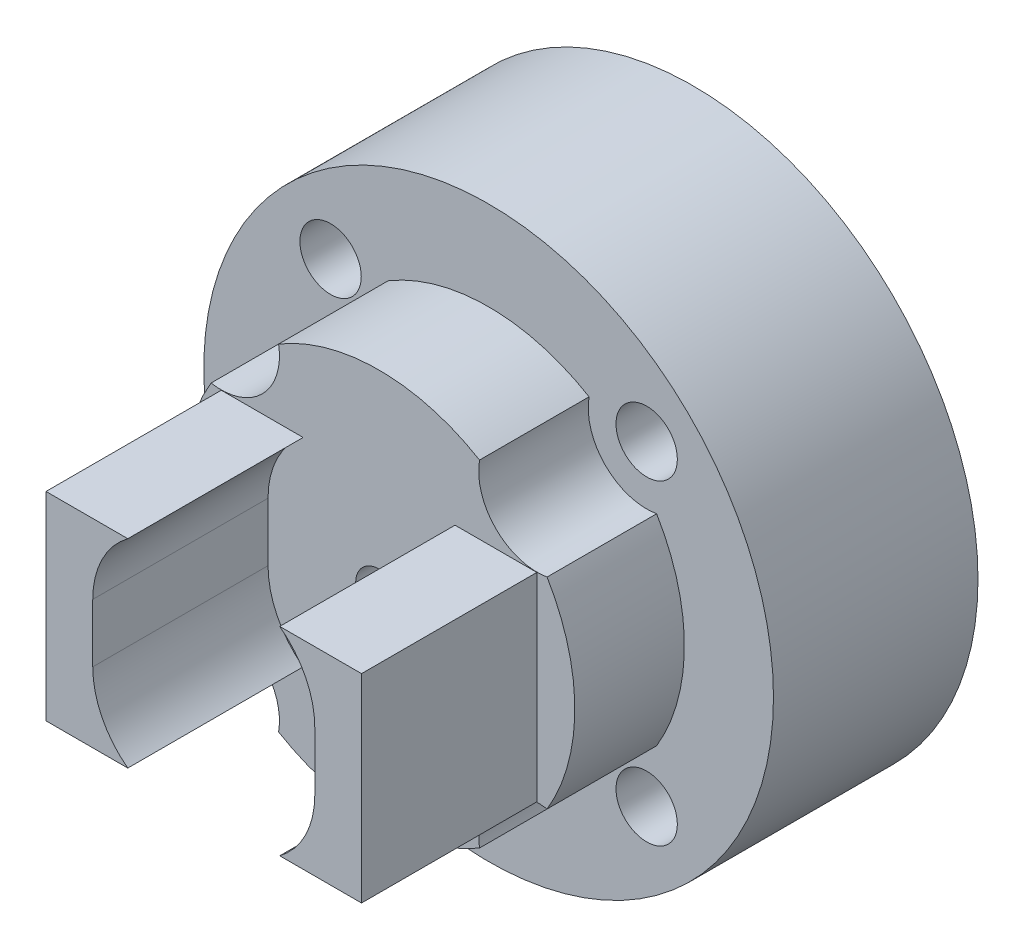
ISO-10303-21;
HEADER;
FILE_DESCRIPTION(('STEP AP214'),'2;1');
FILE_NAME('part.step','',(''),(''),'','','');
FILE_SCHEMA(('AUTOMOTIVE_DESIGN { 1 0 10303 214 1 1 1 1 }'));
ENDSEC;
DATA;
#1=APPLICATION_CONTEXT('core data for automotive mechanical design processes');
#2=APPLICATION_PROTOCOL_DEFINITION('international standard','automotive_design',2000,#1);
#3=PRODUCT_CONTEXT('',#1,'mechanical');
#4=PRODUCT('Part','Part','',(#3));
#5=PRODUCT_RELATED_PRODUCT_CATEGORY('part','',(#4));
#6=PRODUCT_DEFINITION_FORMATION('','',#4);
#7=PRODUCT_DEFINITION_CONTEXT('part definition',#1,'design');
#8=PRODUCT_DEFINITION('design','',#6,#7);
#9=PRODUCT_DEFINITION_SHAPE('','',#8);
#10=(LENGTH_UNIT() NAMED_UNIT(*) SI_UNIT(.MILLI.,.METRE.));
#11=(NAMED_UNIT(*) PLANE_ANGLE_UNIT() SI_UNIT($,.RADIAN.));
#12=(NAMED_UNIT(*) SI_UNIT($,.STERADIAN.) SOLID_ANGLE_UNIT());
#13=UNCERTAINTY_MEASURE_WITH_UNIT(LENGTH_MEASURE(1.E-05),#10,'distance_accuracy_value','');
#14=(GEOMETRIC_REPRESENTATION_CONTEXT(3) GLOBAL_UNCERTAINTY_ASSIGNED_CONTEXT((#13)) GLOBAL_UNIT_ASSIGNED_CONTEXT((#10,
#11,#12)) REPRESENTATION_CONTEXT('',''));
#15=CARTESIAN_POINT('',(0.,0.,0.));
#16=DIRECTION('',(0.,0.,1.));
#17=DIRECTION('',(1.,0.,0.));
#18=AXIS2_PLACEMENT_3D('',#15,#16,#17);
#19=CARTESIAN_POINT('',(-5.4093668760771,-5.40936687607708,-7.));
#20=DIRECTION('',(0.,0.,1.));
#21=DIRECTION('',(1.,0.,0.));
#22=AXIS2_PLACEMENT_3D('',#19,#20,#21);
#23=CYLINDRICAL_SURFACE('',#22,1.05);
#24=CARTESIAN_POINT('',(-5.4093668760771,-5.40936687607708,-7.));
#25=DIRECTION('',(0.,0.,1.));
#26=DIRECTION('',(1.,0.,0.));
#27=AXIS2_PLACEMENT_3D('',#24,#25,#26);
#28=CIRCLE('',#27,1.05);
#29=CARTESIAN_POINT('',(-4.3593668760771,-5.40936687607708,-7.));
#30=VERTEX_POINT('',#29);
#31=EDGE_CURVE('E329',#30,#30,#28,.T.);
#32=ORIENTED_EDGE('',*,*,#31,.F.);
#33=EDGE_LOOP('',(#32));
#34=FACE_BOUND('',#33,.T.);
#35=CARTESIAN_POINT('',(-5.4093668760771,-5.40936687607708,0.));
#36=DIRECTION('',(0.,0.,1.));
#37=DIRECTION('',(1.,0.,0.));
#38=AXIS2_PLACEMENT_3D('',#35,#36,#37);
#39=CIRCLE('',#38,1.05);
#40=CARTESIAN_POINT('',(-4.3593668760771,-5.40936687607708,0.));
#41=VERTEX_POINT('',#40);
#42=EDGE_CURVE('E332',#41,#41,#39,.T.);
#43=ORIENTED_EDGE('',*,*,#42,.T.);
#44=EDGE_LOOP('',(#43));
#45=FACE_BOUND('',#44,.T.);
#46=ADVANCED_FACE('F45',(#34,#45),#23,.F.);
#47=CARTESIAN_POINT('',(5.40936687607708,-5.4093668760771,-7.));
#48=DIRECTION('',(0.,0.,1.));
#49=DIRECTION('',(1.,0.,0.));
#50=AXIS2_PLACEMENT_3D('',#47,#48,#49);
#51=CYLINDRICAL_SURFACE('',#50,1.05);
#52=CARTESIAN_POINT('',(5.40936687607708,-5.4093668760771,-7.));
#53=DIRECTION('',(0.,0.,1.));
#54=DIRECTION('',(1.,0.,0.));
#55=AXIS2_PLACEMENT_3D('',#52,#53,#54);
#56=CIRCLE('',#55,1.05);
#57=CARTESIAN_POINT('',(6.45936687607708,-5.4093668760771,-7.));
#58=VERTEX_POINT('',#57);
#59=EDGE_CURVE('E335',#58,#58,#56,.T.);
#60=ORIENTED_EDGE('',*,*,#59,.F.);
#61=EDGE_LOOP('',(#60));
#62=FACE_BOUND('',#61,.T.);
#63=CARTESIAN_POINT('',(5.40936687607708,-5.4093668760771,0.));
#64=DIRECTION('',(0.,0.,1.));
#65=DIRECTION('',(1.,0.,0.));
#66=AXIS2_PLACEMENT_3D('',#63,#64,#65);
#67=CIRCLE('',#66,1.05);
#68=CARTESIAN_POINT('',(6.45936687607708,-5.4093668760771,0.));
#69=VERTEX_POINT('',#68);
#70=EDGE_CURVE('E338',#69,#69,#67,.T.);
#71=ORIENTED_EDGE('',*,*,#70,.T.);
#72=EDGE_LOOP('',(#71));
#73=FACE_BOUND('',#72,.T.);
#74=ADVANCED_FACE('F394',(#62,#73),#51,.F.);
#75=CARTESIAN_POINT('',(5.4093668760771,5.40936687607708,-7.));
#76=DIRECTION('',(0.,0.,1.));
#77=DIRECTION('',(1.,0.,0.));
#78=AXIS2_PLACEMENT_3D('',#75,#76,#77);
#79=CYLINDRICAL_SURFACE('',#78,1.05);
#80=CARTESIAN_POINT('',(5.4093668760771,5.40936687607708,-7.));
#81=DIRECTION('',(0.,0.,1.));
#82=DIRECTION('',(1.,0.,0.));
#83=AXIS2_PLACEMENT_3D('',#80,#81,#82);
#84=CIRCLE('',#83,1.05);
#85=CARTESIAN_POINT('',(6.4593668760771,5.40936687607708,-7.));
#86=VERTEX_POINT('',#85);
#87=EDGE_CURVE('E341',#86,#86,#84,.T.);
#88=ORIENTED_EDGE('',*,*,#87,.F.);
#89=EDGE_LOOP('',(#88));
#90=FACE_BOUND('',#89,.T.);
#91=CARTESIAN_POINT('',(5.4093668760771,5.40936687607708,0.));
#92=DIRECTION('',(0.,0.,1.));
#93=DIRECTION('',(1.,0.,0.));
#94=AXIS2_PLACEMENT_3D('',#91,#92,#93);
#95=CIRCLE('',#94,1.05);
#96=CARTESIAN_POINT('',(6.4593668760771,5.40936687607708,0.));
#97=VERTEX_POINT('',#96);
#98=EDGE_CURVE('E344',#97,#97,#95,.T.);
#99=ORIENTED_EDGE('',*,*,#98,.T.);
#100=EDGE_LOOP('',(#99));
#101=FACE_BOUND('',#100,.T.);
#102=ADVANCED_FACE('F400',(#90,#101),#79,.F.);
#103=CARTESIAN_POINT('',(-5.40936687607708,5.4093668760771,-7.));
#104=DIRECTION('',(0.,0.,1.));
#105=DIRECTION('',(1.,0.,0.));
#106=AXIS2_PLACEMENT_3D('',#103,#104,#105);
#107=CYLINDRICAL_SURFACE('',#106,1.05);
#108=CARTESIAN_POINT('',(-5.40936687607708,5.4093668760771,-7.));
#109=DIRECTION('',(0.,0.,1.));
#110=DIRECTION('',(1.,0.,0.));
#111=AXIS2_PLACEMENT_3D('',#108,#109,#110);
#112=CIRCLE('',#111,1.05);
#113=CARTESIAN_POINT('',(-4.35936687607708,5.4093668760771,-7.));
#114=VERTEX_POINT('',#113);
#115=EDGE_CURVE('E347',#114,#114,#112,.T.);
#116=ORIENTED_EDGE('',*,*,#115,.F.);
#117=EDGE_LOOP('',(#116));
#118=FACE_BOUND('',#117,.T.);
#119=CARTESIAN_POINT('',(-5.40936687607708,5.4093668760771,0.));
#120=DIRECTION('',(0.,0.,1.));
#121=DIRECTION('',(1.,0.,0.));
#122=AXIS2_PLACEMENT_3D('',#119,#120,#121);
#123=CIRCLE('',#122,1.05);
#124=CARTESIAN_POINT('',(-4.35936687607708,5.4093668760771,0.));
#125=VERTEX_POINT('',#124);
#126=EDGE_CURVE('E350',#125,#125,#123,.T.);
#127=ORIENTED_EDGE('',*,*,#126,.T.);
#128=EDGE_LOOP('',(#127));
#129=FACE_BOUND('',#128,.T.);
#130=ADVANCED_FACE('F411',(#118,#129),#107,.F.);
#131=CARTESIAN_POINT('',(0.,0.,3.75));
#132=DIRECTION('',(0.,0.,-1.));
#133=DIRECTION('',(-1.,0.,0.));
#134=AXIS2_PLACEMENT_3D('',#131,#132,#133);
#135=CYLINDRICAL_SURFACE('',#134,6.7);
#136=CARTESIAN_POINT('',(0.,0.,0.));
#137=DIRECTION('',(0.,0.,1.));
#138=DIRECTION('',(1.,0.,0.));
#139=AXIS2_PLACEMENT_3D('',#136,#137,#138);
#140=CIRCLE('',#139,6.7);
#141=CARTESIAN_POINT('',(-5.75028464837844,3.43863729733498,0.));
#142=VERTEX_POINT('',#141);
#143=CARTESIAN_POINT('',(-5.75028464837845,-3.43863729733497,0.));
#144=VERTEX_POINT('',#143);
#145=EDGE_CURVE('E360',#142,#144,#140,.T.);
#146=ORIENTED_EDGE('',*,*,#145,.T.);
#147=DIRECTION('',(0.,0.,1.));
#148=VECTOR('',#147,1.);
#149=CARTESIAN_POINT('',(-5.75028464837845,-3.43863729733497,1.875));
#150=LINE('',#149,#148);
#151=CARTESIAN_POINT('',(-5.75028464837845,-3.43863729733497,3.75));
#152=VERTEX_POINT('',#151);
#153=EDGE_CURVE('E293',#144,#152,#150,.T.);
#154=ORIENTED_EDGE('',*,*,#153,.T.);
#155=CARTESIAN_POINT('',(0.,0.,3.75));
#156=DIRECTION('',(0.,0.,1.));
#157=DIRECTION('',(1.,0.,0.));
#158=AXIS2_PLACEMENT_3D('',#155,#156,#157);
#159=CIRCLE('',#158,6.7);
#160=CARTESIAN_POINT('',(-5.75028464837844,3.43863729733498,3.75));
#161=VERTEX_POINT('',#160);
#162=EDGE_CURVE('E365',#161,#152,#159,.T.);
#163=ORIENTED_EDGE('',*,*,#162,.F.);
#164=DIRECTION('',(0.,0.,1.));
#165=VECTOR('',#164,1.);
#166=CARTESIAN_POINT('',(-5.75028464837844,3.43863729733498,1.875));
#167=LINE('',#166,#165);
#168=EDGE_CURVE('E326',#161,#142,#167,.F.);
#169=ORIENTED_EDGE('',*,*,#168,.T.);
#170=EDGE_LOOP('',(#146,#154,#163,#169));
#171=FACE_BOUND('',#170,.T.);
#172=ADVANCED_FACE('F415',(#171),#135,.T.);
#173=CARTESIAN_POINT('',(-3.43863729733498,-5.75028464837844,3.75));
#174=VERTEX_POINT('',#173);
#175=CARTESIAN_POINT('',(3.43863729733496,-5.75028464837845,3.75));
#176=VERTEX_POINT('',#175);
#177=EDGE_CURVE('E369',#174,#176,#159,.T.);
#178=ORIENTED_EDGE('',*,*,#177,.F.);
#179=DIRECTION('',(0.,0.,1.));
#180=VECTOR('',#179,1.);
#181=CARTESIAN_POINT('',(-3.43863729733498,-5.75028464837844,1.875));
#182=LINE('',#181,#180);
#183=CARTESIAN_POINT('',(-3.43863729733498,-5.75028464837844,0.));
#184=VERTEX_POINT('',#183);
#185=EDGE_CURVE('E289',#174,#184,#182,.F.);
#186=ORIENTED_EDGE('',*,*,#185,.T.);
#187=CARTESIAN_POINT('',(3.43863729733496,-5.75028464837845,0.));
#188=VERTEX_POINT('',#187);
#189=EDGE_CURVE('E364',#184,#188,#140,.T.);
#190=ORIENTED_EDGE('',*,*,#189,.T.);
#191=DIRECTION('',(0.,0.,1.));
#192=VECTOR('',#191,1.);
#193=CARTESIAN_POINT('',(3.43863729733496,-5.75028464837845,1.875));
#194=LINE('',#193,#192);
#195=EDGE_CURVE('E304',#188,#176,#194,.T.);
#196=ORIENTED_EDGE('',*,*,#195,.T.);
#197=EDGE_LOOP('',(#178,#186,#190,#196));
#198=FACE_BOUND('',#197,.T.);
#199=ADVANCED_FACE('F445',(#198),#135,.T.);
#200=CARTESIAN_POINT('',(5.75028464837844,-3.43863729733498,3.75));
#201=VERTEX_POINT('',#200);
#202=CARTESIAN_POINT('',(5.75028464837845,3.43863729733497,3.75));
#203=VERTEX_POINT('',#202);
#204=EDGE_CURVE('E468',#201,#203,#159,.T.);
#205=ORIENTED_EDGE('',*,*,#204,.F.);
#206=DIRECTION('',(0.,0.,1.));
#207=VECTOR('',#206,1.);
#208=CARTESIAN_POINT('',(5.75028464837844,-3.43863729733498,1.875));
#209=LINE('',#208,#207);
#210=CARTESIAN_POINT('',(5.75028464837844,-3.43863729733498,0.));
#211=VERTEX_POINT('',#210);
#212=EDGE_CURVE('E299',#201,#211,#209,.F.);
#213=ORIENTED_EDGE('',*,*,#212,.T.);
#214=CARTESIAN_POINT('',(5.75028464837845,3.43863729733497,0.));
#215=VERTEX_POINT('',#214);
#216=EDGE_CURVE('E475',#211,#215,#140,.T.);
#217=ORIENTED_EDGE('',*,*,#216,.T.);
#218=DIRECTION('',(0.,0.,1.));
#219=VECTOR('',#218,1.);
#220=CARTESIAN_POINT('',(5.75028464837845,3.43863729733497,1.875));
#221=LINE('',#220,#219);
#222=EDGE_CURVE('E315',#215,#203,#221,.T.);
#223=ORIENTED_EDGE('',*,*,#222,.T.);
#224=EDGE_LOOP('',(#205,#213,#217,#223));
#225=FACE_BOUND('',#224,.T.);
#226=ADVANCED_FACE('F440',(#225),#135,.T.);
#227=CARTESIAN_POINT('',(3.43863729733498,5.75028464837844,3.75));
#228=VERTEX_POINT('',#227);
#229=CARTESIAN_POINT('',(-3.43863729733497,5.75028464837845,3.75));
#230=VERTEX_POINT('',#229);
#231=EDGE_CURVE('E363',#228,#230,#159,.T.);
#232=ORIENTED_EDGE('',*,*,#231,.F.);
#233=DIRECTION('',(0.,0.,1.));
#234=VECTOR('',#233,1.);
#235=CARTESIAN_POINT('',(3.43863729733498,5.75028464837844,1.875));
#236=LINE('',#235,#234);
#237=CARTESIAN_POINT('',(3.43863729733498,5.75028464837844,0.));
#238=VERTEX_POINT('',#237);
#239=EDGE_CURVE('E310',#228,#238,#236,.F.);
#240=ORIENTED_EDGE('',*,*,#239,.T.);
#241=CARTESIAN_POINT('',(-3.43863729733497,5.75028464837845,0.));
#242=VERTEX_POINT('',#241);
#243=EDGE_CURVE('E357',#238,#242,#140,.T.);
#244=ORIENTED_EDGE('',*,*,#243,.T.);
#245=DIRECTION('',(0.,0.,1.));
#246=VECTOR('',#245,1.);
#247=CARTESIAN_POINT('',(-3.43863729733497,5.75028464837845,1.875));
#248=LINE('',#247,#246);
#249=EDGE_CURVE('E321',#242,#230,#248,.T.);
#250=ORIENTED_EDGE('',*,*,#249,.T.);
#251=EDGE_LOOP('',(#232,#240,#244,#250));
#252=FACE_BOUND('',#251,.T.);
#253=ADVANCED_FACE('F435',(#252),#135,.T.);
#254=CARTESIAN_POINT('',(0.,0.,3.75));
#255=DIRECTION('',(0.,0.,1.));
#256=DIRECTION('',(1.,0.,0.));
#257=AXIS2_PLACEMENT_3D('',#254,#255,#256);
#258=PLANE('',#257);
#259=CARTESIAN_POINT('',(0.,0.,3.75));
#260=DIRECTION('',(0.,0.,1.));
#261=DIRECTION('',(1.,0.,0.));
#262=AXIS2_PLACEMENT_3D('',#259,#260,#261);
#263=CIRCLE('',#262,0.799999999999988);
#264=CARTESIAN_POINT('',(0.799999999999988,0.,3.75));
#265=VERTEX_POINT('',#264);
#266=EDGE_CURVE('E213',#265,#265,#263,.T.);
#267=ORIENTED_EDGE('',*,*,#266,.F.);
#268=EDGE_LOOP('',(#267));
#269=FACE_BOUND('',#268,.T.);
#270=CARTESIAN_POINT('',(0.799999999999999,0.999999999999997,3.75));
#271=DIRECTION('',(0.,0.,1.));
#272=DIRECTION('',(1.,0.,0.));
#273=AXIS2_PLACEMENT_3D('',#270,#271,#272);
#274=CIRCLE('',#273,3.);
#275=CARTESIAN_POINT('',(3.8,0.999999999999988,3.75));
#276=VERTEX_POINT('',#275);
#277=CARTESIAN_POINT('',(2.60000000000001,3.39999999999999,3.75));
#278=VERTEX_POINT('',#277);
#279=EDGE_CURVE('E189',#276,#278,#274,.T.);
#280=ORIENTED_EDGE('',*,*,#279,.T.);
#281=DIRECTION('',(-1.,0.,0.));
#282=VECTOR('',#281,1.);
#283=CARTESIAN_POINT('',(0.,3.4,3.75));
#284=LINE('',#283,#282);
#285=CARTESIAN_POINT('',(5.40000000000001,3.39999999999998,3.75));
#286=VERTEX_POINT('',#285);
#287=EDGE_CURVE('E208',#286,#278,#284,.T.);
#288=ORIENTED_EDGE('',*,*,#287,.F.);
#289=DIRECTION('',(0.,-1.,0.));
#290=VECTOR('',#289,1.);
#291=CARTESIAN_POINT('',(5.4,0.,3.75));
#292=LINE('',#291,#290);
#293=CARTESIAN_POINT('',(5.39999999999998,-3.40000000000002,3.75));
#294=VERTEX_POINT('',#293);
#295=EDGE_CURVE('E61',#286,#294,#292,.T.);
#296=ORIENTED_EDGE('',*,*,#295,.T.);
#297=DIRECTION('',(-1.,0.,0.));
#298=VECTOR('',#297,1.);
#299=CARTESIAN_POINT('',(0.,-3.4,3.75));
#300=LINE('',#299,#298);
#301=CARTESIAN_POINT('',(2.59999999999998,-3.40000000000001,3.75));
#302=VERTEX_POINT('',#301);
#303=EDGE_CURVE('E230',#294,#302,#300,.T.);
#304=ORIENTED_EDGE('',*,*,#303,.T.);
#305=CARTESIAN_POINT('',(0.799999999999992,-1.,3.75));
#306=DIRECTION('',(0.,0.,1.));
#307=DIRECTION('',(1.,0.,0.));
#308=AXIS2_PLACEMENT_3D('',#305,#306,#307);
#309=CIRCLE('',#308,3.);
#310=CARTESIAN_POINT('',(3.79999999999999,-1.00000000000001,3.75));
#311=VERTEX_POINT('',#310);
#312=EDGE_CURVE('E227',#311,#302,#309,.F.);
#313=ORIENTED_EDGE('',*,*,#312,.F.);
#314=DIRECTION('',(0.,-1.,0.));
#315=VECTOR('',#314,1.);
#316=CARTESIAN_POINT('',(3.8,0.,3.75));
#317=LINE('',#316,#315);
#318=EDGE_CURVE('E225',#276,#311,#317,.T.);
#319=ORIENTED_EDGE('',*,*,#318,.F.);
#320=EDGE_LOOP('',(#280,#288,#296,#304,#313,#319));
#321=FACE_BOUND('',#320,.T.);
#322=DIRECTION('',(0.,-1.,0.));
#323=VECTOR('',#322,1.);
#324=CARTESIAN_POINT('',(-3.8,0.,3.75));
#325=LINE('',#324,#323);
#326=CARTESIAN_POINT('',(-3.8,1.,3.75));
#327=VERTEX_POINT('',#326);
#328=CARTESIAN_POINT('',(-3.8,-1.,3.75));
#329=VERTEX_POINT('',#328);
#330=EDGE_CURVE('E192',#327,#329,#325,.T.);
#331=ORIENTED_EDGE('',*,*,#330,.T.);
#332=CARTESIAN_POINT('',(-0.799999999999999,-1.,3.75));
#333=DIRECTION('',(0.,0.,1.));
#334=DIRECTION('',(1.,0.,0.));
#335=AXIS2_PLACEMENT_3D('',#332,#333,#334);
#336=CIRCLE('',#335,3.);
#337=CARTESIAN_POINT('',(-2.6,-3.4,3.75));
#338=VERTEX_POINT('',#337);
#339=EDGE_CURVE('E246',#329,#338,#336,.T.);
#340=ORIENTED_EDGE('',*,*,#339,.T.);
#341=DIRECTION('',(1.,0.,0.));
#342=VECTOR('',#341,1.);
#343=CARTESIAN_POINT('',(0.,-3.4,3.75));
#344=LINE('',#343,#342);
#345=CARTESIAN_POINT('',(-5.4,-3.4,3.75));
#346=VERTEX_POINT('',#345);
#347=EDGE_CURVE('E266',#346,#338,#344,.T.);
#348=ORIENTED_EDGE('',*,*,#347,.F.);
#349=DIRECTION('',(0.,-1.,0.));
#350=VECTOR('',#349,1.);
#351=CARTESIAN_POINT('',(-5.4,0.,3.75));
#352=LINE('',#351,#350);
#353=CARTESIAN_POINT('',(-5.4,3.4,3.75));
#354=VERTEX_POINT('',#353);
#355=EDGE_CURVE('E263',#354,#346,#352,.T.);
#356=ORIENTED_EDGE('',*,*,#355,.F.);
#357=DIRECTION('',(1.,0.,0.));
#358=VECTOR('',#357,1.);
#359=CARTESIAN_POINT('',(0.,3.4,3.75));
#360=LINE('',#359,#358);
#361=CARTESIAN_POINT('',(-2.6,3.4,3.75));
#362=VERTEX_POINT('',#361);
#363=EDGE_CURVE('E261',#354,#362,#360,.T.);
#364=ORIENTED_EDGE('',*,*,#363,.T.);
#365=CARTESIAN_POINT('',(-0.799999999999999,1.,3.75));
#366=DIRECTION('',(0.,0.,1.));
#367=DIRECTION('',(1.,0.,0.));
#368=AXIS2_PLACEMENT_3D('',#365,#366,#367);
#369=CIRCLE('',#368,3.);
#370=EDGE_CURVE('E69',#327,#362,#369,.F.);
#371=ORIENTED_EDGE('',*,*,#370,.F.);
#372=EDGE_LOOP('',(#331,#340,#348,#356,#364,#371));
#373=FACE_BOUND('',#372,.T.);
#374=CARTESIAN_POINT('',(-5.4093668760771,-5.40936687607708,3.75));
#375=DIRECTION('',(0.,0.,1.));
#376=DIRECTION('',(1.,0.,0.));
#377=AXIS2_PLACEMENT_3D('',#374,#375,#376);
#378=CIRCLE('',#377,2.);
#379=EDGE_CURVE('E286',#174,#152,#378,.T.);
#380=ORIENTED_EDGE('',*,*,#379,.F.);
#381=ORIENTED_EDGE('',*,*,#177,.T.);
#382=CARTESIAN_POINT('',(5.40936687607708,-5.4093668760771,3.75));
#383=DIRECTION('',(0.,0.,1.));
#384=DIRECTION('',(1.,0.,0.));
#385=AXIS2_PLACEMENT_3D('',#382,#383,#384);
#386=CIRCLE('',#385,2.);
#387=EDGE_CURVE('E296',#201,#176,#386,.T.);
#388=ORIENTED_EDGE('',*,*,#387,.F.);
#389=ORIENTED_EDGE('',*,*,#204,.T.);
#390=CARTESIAN_POINT('',(5.4093668760771,5.40936687607708,3.75));
#391=DIRECTION('',(0.,0.,1.));
#392=DIRECTION('',(1.,0.,0.));
#393=AXIS2_PLACEMENT_3D('',#390,#391,#392);
#394=CIRCLE('',#393,2.);
#395=EDGE_CURVE('E307',#228,#203,#394,.T.);
#396=ORIENTED_EDGE('',*,*,#395,.F.);
#397=ORIENTED_EDGE('',*,*,#231,.T.);
#398=CARTESIAN_POINT('',(-5.40936687607708,5.4093668760771,3.75));
#399=DIRECTION('',(0.,0.,1.));
#400=DIRECTION('',(1.,0.,0.));
#401=AXIS2_PLACEMENT_3D('',#398,#399,#400);
#402=CIRCLE('',#401,2.);
#403=EDGE_CURVE('E318',#161,#230,#402,.T.);
#404=ORIENTED_EDGE('',*,*,#403,.F.);
#405=ORIENTED_EDGE('',*,*,#162,.T.);
#406=EDGE_LOOP('',(#380,#381,#388,#389,#396,#397,#404,#405));
#407=FACE_BOUND('',#406,.T.);
#408=ADVANCED_FACE('F428',(#269,#321,#373,#407),#258,.T.);
#409=CARTESIAN_POINT('',(0.,0.,0.));
#410=DIRECTION('',(0.,0.,1.));
#411=DIRECTION('',(1.,0.,0.));
#412=AXIS2_PLACEMENT_3D('',#409,#410,#411);
#413=PLANE('',#412);
#414=ORIENTED_EDGE('',*,*,#42,.F.);
#415=EDGE_LOOP('',(#414));
#416=FACE_BOUND('',#415,.T.);
#417=ORIENTED_EDGE('',*,*,#189,.F.);
#418=CARTESIAN_POINT('',(-5.4093668760771,-5.40936687607708,0.));
#419=DIRECTION('',(0.,0.,1.));
#420=DIRECTION('',(1.,0.,0.));
#421=AXIS2_PLACEMENT_3D('',#418,#419,#420);
#422=CIRCLE('',#421,2.);
#423=EDGE_CURVE('E287',#144,#184,#422,.F.);
#424=ORIENTED_EDGE('',*,*,#423,.F.);
#425=ORIENTED_EDGE('',*,*,#145,.F.);
#426=CARTESIAN_POINT('',(-5.40936687607708,5.4093668760771,0.));
#427=DIRECTION('',(0.,0.,1.));
#428=DIRECTION('',(1.,0.,0.));
#429=AXIS2_PLACEMENT_3D('',#426,#427,#428);
#430=CIRCLE('',#429,2.);
#431=EDGE_CURVE('E319',#242,#142,#430,.F.);
#432=ORIENTED_EDGE('',*,*,#431,.F.);
#433=ORIENTED_EDGE('',*,*,#243,.F.);
#434=CARTESIAN_POINT('',(5.4093668760771,5.40936687607708,0.));
#435=DIRECTION('',(0.,0.,1.));
#436=DIRECTION('',(1.,0.,0.));
#437=AXIS2_PLACEMENT_3D('',#434,#435,#436);
#438=CIRCLE('',#437,2.);
#439=EDGE_CURVE('E308',#215,#238,#438,.F.);
#440=ORIENTED_EDGE('',*,*,#439,.F.);
#441=ORIENTED_EDGE('',*,*,#216,.F.);
#442=CARTESIAN_POINT('',(5.40936687607708,-5.4093668760771,0.));
#443=DIRECTION('',(0.,0.,1.));
#444=DIRECTION('',(1.,0.,0.));
#445=AXIS2_PLACEMENT_3D('',#442,#443,#444);
#446=CIRCLE('',#445,2.);
#447=EDGE_CURVE('E297',#188,#211,#446,.F.);
#448=ORIENTED_EDGE('',*,*,#447,.F.);
#449=EDGE_LOOP('',(#417,#424,#425,#432,#433,#440,#441,#448));
#450=FACE_BOUND('',#449,.T.);
#451=ORIENTED_EDGE('',*,*,#70,.F.);
#452=EDGE_LOOP('',(#451));
#453=FACE_BOUND('',#452,.T.);
#454=ORIENTED_EDGE('',*,*,#98,.F.);
#455=EDGE_LOOP('',(#454));
#456=FACE_BOUND('',#455,.T.);
#457=ORIENTED_EDGE('',*,*,#126,.F.);
#458=EDGE_LOOP('',(#457));
#459=FACE_BOUND('',#458,.T.);
#460=CARTESIAN_POINT('',(0.,0.,0.));
#461=DIRECTION('',(0.,0.,1.));
#462=DIRECTION('',(1.,0.,0.));
#463=AXIS2_PLACEMENT_3D('',#460,#461,#462);
#464=CIRCLE('',#463,9.75);
#465=CARTESIAN_POINT('',(9.75,0.,0.));
#466=VERTEX_POINT('',#465);
#467=EDGE_CURVE('E353',#466,#466,#464,.T.);
#468=ORIENTED_EDGE('',*,*,#467,.T.);
#469=EDGE_LOOP('',(#468));
#470=FACE_BOUND('',#469,.T.);
#471=ADVANCED_FACE('F425',(#416,#450,#453,#456,#459,#470),#413,.T.);
#472=CARTESIAN_POINT('',(0.,0.,-7.));
#473=DIRECTION('',(0.,0.,1.));
#474=DIRECTION('',(1.,0.,0.));
#475=AXIS2_PLACEMENT_3D('',#472,#473,#474);
#476=CYLINDRICAL_SURFACE('',#475,9.75);
#477=CARTESIAN_POINT('',(0.,0.,-7.));
#478=DIRECTION('',(0.,0.,1.));
#479=DIRECTION('',(1.,0.,0.));
#480=AXIS2_PLACEMENT_3D('',#477,#478,#479);
#481=CIRCLE('',#480,9.75);
#482=CARTESIAN_POINT('',(9.75,0.,-7.));
#483=VERTEX_POINT('',#482);
#484=EDGE_CURVE('E354',#483,#483,#481,.T.);
#485=ORIENTED_EDGE('',*,*,#484,.T.);
#486=EDGE_LOOP('',(#485));
#487=FACE_BOUND('',#486,.T.);
#488=ORIENTED_EDGE('',*,*,#467,.F.);
#489=EDGE_LOOP('',(#488));
#490=FACE_BOUND('',#489,.T.);
#491=ADVANCED_FACE('F424',(#487,#490),#476,.T.);
#492=CARTESIAN_POINT('',(0.,0.,-7.));
#493=DIRECTION('',(0.,0.,1.));
#494=DIRECTION('',(1.,0.,0.));
#495=AXIS2_PLACEMENT_3D('',#492,#493,#494);
#496=PLANE('',#495);
#497=CARTESIAN_POINT('',(0.,0.,-7.));
#498=DIRECTION('',(0.,0.,1.));
#499=DIRECTION('',(1.,0.,0.));
#500=AXIS2_PLACEMENT_3D('',#497,#498,#499);
#501=CIRCLE('',#500,3.85);
#502=CARTESIAN_POINT('',(3.85,0.,-7.));
#503=VERTEX_POINT('',#502);
#504=EDGE_CURVE('E54',#503,#503,#501,.T.);
#505=ORIENTED_EDGE('',*,*,#504,.T.);
#506=EDGE_LOOP('',(#505));
#507=FACE_BOUND('',#506,.T.);
#508=ORIENTED_EDGE('',*,*,#31,.T.);
#509=EDGE_LOOP('',(#508));
#510=FACE_BOUND('',#509,.T.);
#511=ORIENTED_EDGE('',*,*,#59,.T.);
#512=EDGE_LOOP('',(#511));
#513=FACE_BOUND('',#512,.T.);
#514=ORIENTED_EDGE('',*,*,#87,.T.);
#515=EDGE_LOOP('',(#514));
#516=FACE_BOUND('',#515,.T.);
#517=ORIENTED_EDGE('',*,*,#115,.T.);
#518=EDGE_LOOP('',(#517));
#519=FACE_BOUND('',#518,.T.);
#520=ORIENTED_EDGE('',*,*,#484,.F.);
#521=EDGE_LOOP('',(#520));
#522=FACE_BOUND('',#521,.T.);
#523=ADVANCED_FACE('F375',(#507,#510,#513,#516,#519,#522),#496,.F.);
#524=CARTESIAN_POINT('',(0.,0.,-7.));
#525=DIRECTION('',(0.,0.,1.));
#526=DIRECTION('',(1.,0.,0.));
#527=AXIS2_PLACEMENT_3D('',#524,#525,#526);
#528=CYLINDRICAL_SURFACE('',#527,3.55);
#529=CARTESIAN_POINT('',(0.,0.,-6.7));
#530=DIRECTION('',(0.,0.,1.));
#531=DIRECTION('',(1.,0.,0.));
#532=AXIS2_PLACEMENT_3D('',#529,#530,#531);
#533=CIRCLE('',#532,3.55);
#534=CARTESIAN_POINT('',(3.55,0.,-6.7));
#535=VERTEX_POINT('',#534);
#536=EDGE_CURVE('E12',#535,#535,#533,.F.);
#537=ORIENTED_EDGE('',*,*,#536,.T.);
#538=EDGE_LOOP('',(#537));
#539=FACE_BOUND('',#538,.T.);
#540=CARTESIAN_POINT('',(0.,0.,0.));
#541=DIRECTION('',(0.,0.,1.));
#542=DIRECTION('',(1.,0.,0.));
#543=AXIS2_PLACEMENT_3D('',#540,#541,#542);
#544=CIRCLE('',#543,3.55);
#545=CARTESIAN_POINT('',(3.55,0.,0.));
#546=VERTEX_POINT('',#545);
#547=EDGE_CURVE('E368',#546,#546,#544,.T.);
#548=ORIENTED_EDGE('',*,*,#547,.T.);
#549=EDGE_LOOP('',(#548));
#550=FACE_BOUND('',#549,.T.);
#551=ADVANCED_FACE('F417',(#539,#550),#528,.F.);
#552=CARTESIAN_POINT('',(0.,0.,0.));
#553=DIRECTION('',(0.,0.,1.));
#554=DIRECTION('',(1.,0.,0.));
#555=AXIS2_PLACEMENT_3D('',#552,#553,#554);
#556=PLANE('',#555);
#557=CARTESIAN_POINT('',(0.,0.,0.));
#558=DIRECTION('',(0.,0.,1.));
#559=DIRECTION('',(1.,0.,0.));
#560=AXIS2_PLACEMENT_3D('',#557,#558,#559);
#561=CIRCLE('',#560,0.799999999999993);
#562=CARTESIAN_POINT('',(0.799999999999993,0.,0.));
#563=VERTEX_POINT('',#562);
#564=EDGE_CURVE('E49',#563,#563,#561,.T.);
#565=ORIENTED_EDGE('',*,*,#564,.T.);
#566=EDGE_LOOP('',(#565));
#567=FACE_BOUND('',#566,.T.);
#568=ORIENTED_EDGE('',*,*,#547,.F.);
#569=EDGE_LOOP('',(#568));
#570=FACE_BOUND('',#569,.T.);
#571=ADVANCED_FACE('F420',(#567,#570),#556,.F.);
#572=CARTESIAN_POINT('',(-5.40936687607708,5.4093668760771,-5.65685424949238));
#573=DIRECTION('',(0.,0.,1.));
#574=DIRECTION('',(1.,0.,0.));
#575=AXIS2_PLACEMENT_3D('',#572,#573,#574);
#576=CYLINDRICAL_SURFACE('',#575,2.);
#577=ORIENTED_EDGE('',*,*,#403,.T.);
#578=ORIENTED_EDGE('',*,*,#249,.F.);
#579=ORIENTED_EDGE('',*,*,#431,.T.);
#580=ORIENTED_EDGE('',*,*,#168,.F.);
#581=EDGE_LOOP('',(#577,#578,#579,#580));
#582=FACE_BOUND('',#581,.T.);
#583=ADVANCED_FACE('F406',(#582),#576,.F.);
#584=CARTESIAN_POINT('',(5.4093668760771,5.40936687607708,-5.65685424949238));
#585=DIRECTION('',(0.,0.,1.));
#586=DIRECTION('',(1.,0.,0.));
#587=AXIS2_PLACEMENT_3D('',#584,#585,#586);
#588=CYLINDRICAL_SURFACE('',#587,2.);
#589=ORIENTED_EDGE('',*,*,#439,.T.);
#590=ORIENTED_EDGE('',*,*,#239,.F.);
#591=ORIENTED_EDGE('',*,*,#395,.T.);
#592=ORIENTED_EDGE('',*,*,#222,.F.);
#593=EDGE_LOOP('',(#589,#590,#591,#592));
#594=FACE_BOUND('',#593,.T.);
#595=ADVANCED_FACE('F479',(#594),#588,.F.);
#596=CARTESIAN_POINT('',(5.40936687607708,-5.4093668760771,-5.65685424949238));
#597=DIRECTION('',(0.,0.,1.));
#598=DIRECTION('',(1.,0.,0.));
#599=AXIS2_PLACEMENT_3D('',#596,#597,#598);
#600=CYLINDRICAL_SURFACE('',#599,2.);
#601=ORIENTED_EDGE('',*,*,#447,.T.);
#602=ORIENTED_EDGE('',*,*,#212,.F.);
#603=ORIENTED_EDGE('',*,*,#387,.T.);
#604=ORIENTED_EDGE('',*,*,#195,.F.);
#605=EDGE_LOOP('',(#601,#602,#603,#604));
#606=FACE_BOUND('',#605,.T.);
#607=ADVANCED_FACE('F389',(#606),#600,.F.);
#608=CARTESIAN_POINT('',(-5.4093668760771,-5.40936687607708,-5.65685424949238));
#609=DIRECTION('',(0.,0.,1.));
#610=DIRECTION('',(1.,0.,0.));
#611=AXIS2_PLACEMENT_3D('',#608,#609,#610);
#612=CYLINDRICAL_SURFACE('',#611,2.);
#613=ORIENTED_EDGE('',*,*,#423,.T.);
#614=ORIENTED_EDGE('',*,*,#185,.F.);
#615=ORIENTED_EDGE('',*,*,#379,.T.);
#616=ORIENTED_EDGE('',*,*,#153,.F.);
#617=EDGE_LOOP('',(#613,#614,#615,#616));
#618=FACE_BOUND('',#617,.T.);
#619=ADVANCED_FACE('F380',(#618),#612,.F.);
#620=CARTESIAN_POINT('',(0.,0.,-7.));
#621=DIRECTION('',(0.,0.,-1.));
#622=DIRECTION('',(-1.,0.,0.));
#623=AXIS2_PLACEMENT_3D('',#620,#621,#622);
#624=CONICAL_SURFACE('',#623,3.85,0.78539816339745);
#625=ORIENTED_EDGE('',*,*,#536,.F.);
#626=EDGE_LOOP('',(#625));
#627=FACE_BOUND('',#626,.T.);
#628=ORIENTED_EDGE('',*,*,#504,.F.);
#629=EDGE_LOOP('',(#628));
#630=FACE_BOUND('',#629,.T.);
#631=ADVANCED_FACE('F47',(#627,#630),#624,.F.);
#632=CARTESIAN_POINT('',(-3.8,0.,9.75));
#633=DIRECTION('',(1.,0.,0.));
#634=DIRECTION('',(0.,0.,-1.));
#635=AXIS2_PLACEMENT_3D('',#632,#633,#634);
#636=PLANE('',#635);
#637=ORIENTED_EDGE('',*,*,#330,.F.);
#638=DIRECTION('',(0.,0.,-1.));
#639=VECTOR('',#638,1.);
#640=CARTESIAN_POINT('',(-3.8,1.,9.75));
#641=LINE('',#640,#639);
#642=CARTESIAN_POINT('',(-3.8,1.,9.75));
#643=VERTEX_POINT('',#642);
#644=EDGE_CURVE('E284',#643,#327,#641,.T.);
#645=ORIENTED_EDGE('',*,*,#644,.F.);
#646=DIRECTION('',(0.,-1.,0.));
#647=VECTOR('',#646,1.);
#648=CARTESIAN_POINT('',(-3.8,0.,9.75));
#649=LINE('',#648,#647);
#650=CARTESIAN_POINT('',(-3.8,-1.,9.75));
#651=VERTEX_POINT('',#650);
#652=EDGE_CURVE('E242',#643,#651,#649,.T.);
#653=ORIENTED_EDGE('',*,*,#652,.T.);
#654=DIRECTION('',(0.,0.,-1.));
#655=VECTOR('',#654,1.);
#656=CARTESIAN_POINT('',(-3.8,-1.,9.75));
#657=LINE('',#656,#655);
#658=EDGE_CURVE('E258',#651,#329,#657,.T.);
#659=ORIENTED_EDGE('',*,*,#658,.T.);
#660=EDGE_LOOP('',(#637,#645,#653,#659));
#661=FACE_BOUND('',#660,.T.);
#662=ADVANCED_FACE('F379',(#661),#636,.T.);
#663=CARTESIAN_POINT('',(-0.799999999999999,1.,9.75));
#664=DIRECTION('',(0.,0.,-1.));
#665=DIRECTION('',(-1.,0.,0.));
#666=AXIS2_PLACEMENT_3D('',#663,#664,#665);
#667=CYLINDRICAL_SURFACE('',#666,3.);
#668=ORIENTED_EDGE('',*,*,#370,.T.);
#669=DIRECTION('',(0.,0.,-1.));
#670=VECTOR('',#669,1.);
#671=CARTESIAN_POINT('',(-2.6,3.4,9.75));
#672=LINE('',#671,#670);
#673=CARTESIAN_POINT('',(-2.6,3.4,9.75));
#674=VERTEX_POINT('',#673);
#675=EDGE_CURVE('E281',#674,#362,#672,.T.);
#676=ORIENTED_EDGE('',*,*,#675,.F.);
#677=CARTESIAN_POINT('',(-0.799999999999999,1.,9.75));
#678=DIRECTION('',(0.,0.,1.));
#679=DIRECTION('',(1.,0.,0.));
#680=AXIS2_PLACEMENT_3D('',#677,#678,#679);
#681=CIRCLE('',#680,3.);
#682=EDGE_CURVE('E245',#643,#674,#681,.F.);
#683=ORIENTED_EDGE('',*,*,#682,.F.);
#684=ORIENTED_EDGE('',*,*,#644,.T.);
#685=EDGE_LOOP('',(#668,#676,#683,#684));
#686=FACE_BOUND('',#685,.T.);
#687=ADVANCED_FACE('F386',(#686),#667,.F.);
#688=CARTESIAN_POINT('',(0.,3.4,9.75));
#689=DIRECTION('',(0.,1.,0.));
#690=DIRECTION('',(-1.,0.,0.));
#691=AXIS2_PLACEMENT_3D('',#688,#689,#690);
#692=PLANE('',#691);
#693=ORIENTED_EDGE('',*,*,#363,.F.);
#694=DIRECTION('',(0.,0.,-1.));
#695=VECTOR('',#694,1.);
#696=CARTESIAN_POINT('',(-5.4,3.4,9.75));
#697=LINE('',#696,#695);
#698=CARTESIAN_POINT('',(-5.4,3.4,9.75));
#699=VERTEX_POINT('',#698);
#700=EDGE_CURVE('E278',#699,#354,#697,.T.);
#701=ORIENTED_EDGE('',*,*,#700,.F.);
#702=DIRECTION('',(1.,0.,0.));
#703=VECTOR('',#702,1.);
#704=CARTESIAN_POINT('',(0.,3.4,9.75));
#705=LINE('',#704,#703);
#706=EDGE_CURVE('E248',#699,#674,#705,.T.);
#707=ORIENTED_EDGE('',*,*,#706,.T.);
#708=ORIENTED_EDGE('',*,*,#675,.T.);
#709=EDGE_LOOP('',(#693,#701,#707,#708));
#710=FACE_BOUND('',#709,.T.);
#711=ADVANCED_FACE('F490',(#710),#692,.T.);
#712=CARTESIAN_POINT('',(-5.4,0.,9.75));
#713=DIRECTION('',(1.,0.,0.));
#714=DIRECTION('',(0.,0.,-1.));
#715=AXIS2_PLACEMENT_3D('',#712,#713,#714);
#716=PLANE('',#715);
#717=ORIENTED_EDGE('',*,*,#355,.T.);
#718=DIRECTION('',(0.,0.,-1.));
#719=VECTOR('',#718,1.);
#720=CARTESIAN_POINT('',(-5.4,-3.4,9.75));
#721=LINE('',#720,#719);
#722=CARTESIAN_POINT('',(-5.4,-3.4,9.75));
#723=VERTEX_POINT('',#722);
#724=EDGE_CURVE('E275',#723,#346,#721,.T.);
#725=ORIENTED_EDGE('',*,*,#724,.F.);
#726=DIRECTION('',(0.,-1.,0.));
#727=VECTOR('',#726,1.);
#728=CARTESIAN_POINT('',(-5.4,0.,9.75));
#729=LINE('',#728,#727);
#730=EDGE_CURVE('E251',#699,#723,#729,.T.);
#731=ORIENTED_EDGE('',*,*,#730,.F.);
#732=ORIENTED_EDGE('',*,*,#700,.T.);
#733=EDGE_LOOP('',(#717,#725,#731,#732));
#734=FACE_BOUND('',#733,.T.);
#735=ADVANCED_FACE('F494',(#734),#716,.F.);
#736=CARTESIAN_POINT('',(0.,-3.4,9.75));
#737=DIRECTION('',(0.,1.,0.));
#738=DIRECTION('',(-1.,0.,0.));
#739=AXIS2_PLACEMENT_3D('',#736,#737,#738);
#740=PLANE('',#739);
#741=ORIENTED_EDGE('',*,*,#347,.T.);
#742=DIRECTION('',(0.,0.,-1.));
#743=VECTOR('',#742,1.);
#744=CARTESIAN_POINT('',(-2.6,-3.4,9.75));
#745=LINE('',#744,#743);
#746=CARTESIAN_POINT('',(-2.6,-3.4,9.75));
#747=VERTEX_POINT('',#746);
#748=EDGE_CURVE('E272',#747,#338,#745,.T.);
#749=ORIENTED_EDGE('',*,*,#748,.F.);
#750=DIRECTION('',(1.,0.,0.));
#751=VECTOR('',#750,1.);
#752=CARTESIAN_POINT('',(0.,-3.4,9.75));
#753=LINE('',#752,#751);
#754=EDGE_CURVE('E253',#723,#747,#753,.T.);
#755=ORIENTED_EDGE('',*,*,#754,.F.);
#756=ORIENTED_EDGE('',*,*,#724,.T.);
#757=EDGE_LOOP('',(#741,#749,#755,#756));
#758=FACE_BOUND('',#757,.T.);
#759=ADVANCED_FACE('F498',(#758),#740,.F.);
#760=CARTESIAN_POINT('',(-0.799999999999999,-1.,9.75));
#761=DIRECTION('',(0.,0.,-1.));
#762=DIRECTION('',(-1.,0.,0.));
#763=AXIS2_PLACEMENT_3D('',#760,#761,#762);
#764=CYLINDRICAL_SURFACE('',#763,3.);
#765=ORIENTED_EDGE('',*,*,#339,.F.);
#766=ORIENTED_EDGE('',*,*,#658,.F.);
#767=CARTESIAN_POINT('',(-0.799999999999999,-1.,9.75));
#768=DIRECTION('',(0.,0.,1.));
#769=DIRECTION('',(1.,0.,0.));
#770=AXIS2_PLACEMENT_3D('',#767,#768,#769);
#771=CIRCLE('',#770,3.);
#772=EDGE_CURVE('E255',#651,#747,#771,.T.);
#773=ORIENTED_EDGE('',*,*,#772,.T.);
#774=ORIENTED_EDGE('',*,*,#748,.T.);
#775=EDGE_LOOP('',(#765,#766,#773,#774));
#776=FACE_BOUND('',#775,.T.);
#777=ADVANCED_FACE('F502',(#776),#764,.F.);
#778=CARTESIAN_POINT('',(0.,0.,9.75));
#779=DIRECTION('',(0.,0.,1.));
#780=DIRECTION('',(1.,0.,0.));
#781=AXIS2_PLACEMENT_3D('',#778,#779,#780);
#782=PLANE('',#781);
#783=ORIENTED_EDGE('',*,*,#652,.F.);
#784=ORIENTED_EDGE('',*,*,#682,.T.);
#785=ORIENTED_EDGE('',*,*,#706,.F.);
#786=ORIENTED_EDGE('',*,*,#730,.T.);
#787=ORIENTED_EDGE('',*,*,#754,.T.);
#788=ORIENTED_EDGE('',*,*,#772,.F.);
#789=EDGE_LOOP('',(#783,#784,#785,#786,#787,#788));
#790=FACE_BOUND('',#789,.T.);
#791=ADVANCED_FACE('F506',(#790),#782,.T.);
#792=CARTESIAN_POINT('',(0.799999999999999,0.999999999999997,9.75));
#793=DIRECTION('',(0.,0.,-1.));
#794=DIRECTION('',(-1.,0.,0.));
#795=AXIS2_PLACEMENT_3D('',#792,#793,#794);
#796=CYLINDRICAL_SURFACE('',#795,3.);
#797=ORIENTED_EDGE('',*,*,#279,.F.);
#798=DIRECTION('',(0.,0.,-1.));
#799=VECTOR('',#798,1.);
#800=CARTESIAN_POINT('',(3.8,0.999999999999988,9.75));
#801=LINE('',#800,#799);
#802=CARTESIAN_POINT('',(3.8,0.999999999999988,9.75));
#803=VERTEX_POINT('',#802);
#804=EDGE_CURVE('E183',#803,#276,#801,.T.);
#805=ORIENTED_EDGE('',*,*,#804,.F.);
#806=CARTESIAN_POINT('',(0.799999999999999,0.999999999999997,9.75));
#807=DIRECTION('',(0.,0.,1.));
#808=DIRECTION('',(1.,0.,0.));
#809=AXIS2_PLACEMENT_3D('',#806,#807,#808);
#810=CIRCLE('',#809,3.);
#811=CARTESIAN_POINT('',(2.60000000000001,3.39999999999999,9.75));
#812=VERTEX_POINT('',#811);
#813=EDGE_CURVE('E187',#803,#812,#810,.T.);
#814=ORIENTED_EDGE('',*,*,#813,.T.);
#815=DIRECTION('',(0.,0.,-1.));
#816=VECTOR('',#815,1.);
#817=CARTESIAN_POINT('',(2.60000000000001,3.39999999999999,9.75));
#818=LINE('',#817,#816);
#819=EDGE_CURVE('E223',#812,#278,#818,.T.);
#820=ORIENTED_EDGE('',*,*,#819,.T.);
#821=EDGE_LOOP('',(#797,#805,#814,#820));
#822=FACE_BOUND('',#821,.T.);
#823=ADVANCED_FACE('F185',(#822),#796,.F.);
#824=CARTESIAN_POINT('',(3.8,0.,9.75));
#825=DIRECTION('',(1.,0.,0.));
#826=DIRECTION('',(0.,1.,0.));
#827=AXIS2_PLACEMENT_3D('',#824,#825,#826);
#828=PLANE('',#827);
#829=ORIENTED_EDGE('',*,*,#318,.T.);
#830=DIRECTION('',(0.,0.,-1.));
#831=VECTOR('',#830,1.);
#832=CARTESIAN_POINT('',(3.79999999999999,-1.00000000000001,9.75));
#833=LINE('',#832,#831);
#834=CARTESIAN_POINT('',(3.79999999999999,-1.00000000000001,9.75));
#835=VERTEX_POINT('',#834);
#836=EDGE_CURVE('E193',#835,#311,#833,.T.);
#837=ORIENTED_EDGE('',*,*,#836,.F.);
#838=DIRECTION('',(0.,-1.,0.));
#839=VECTOR('',#838,1.);
#840=CARTESIAN_POINT('',(3.8,0.,9.75));
#841=LINE('',#840,#839);
#842=EDGE_CURVE('E196',#803,#835,#841,.T.);
#843=ORIENTED_EDGE('',*,*,#842,.F.);
#844=ORIENTED_EDGE('',*,*,#804,.T.);
#845=EDGE_LOOP('',(#829,#837,#843,#844));
#846=FACE_BOUND('',#845,.T.);
#847=ADVANCED_FACE('F197',(#846),#828,.F.);
#848=CARTESIAN_POINT('',(0.799999999999992,-1.,9.75));
#849=DIRECTION('',(0.,0.,-1.));
#850=DIRECTION('',(-1.,0.,0.));
#851=AXIS2_PLACEMENT_3D('',#848,#849,#850);
#852=CYLINDRICAL_SURFACE('',#851,3.);
#853=ORIENTED_EDGE('',*,*,#312,.T.);
#854=DIRECTION('',(0.,0.,-1.));
#855=VECTOR('',#854,1.);
#856=CARTESIAN_POINT('',(2.59999999999998,-3.40000000000001,9.75));
#857=LINE('',#856,#855);
#858=CARTESIAN_POINT('',(2.59999999999998,-3.40000000000001,9.75));
#859=VERTEX_POINT('',#858);
#860=EDGE_CURVE('E239',#859,#302,#857,.T.);
#861=ORIENTED_EDGE('',*,*,#860,.F.);
#862=CARTESIAN_POINT('',(0.799999999999992,-1.,9.75));
#863=DIRECTION('',(0.,0.,1.));
#864=DIRECTION('',(1.,0.,0.));
#865=AXIS2_PLACEMENT_3D('',#862,#863,#864);
#866=CIRCLE('',#865,3.);
#867=EDGE_CURVE('E201',#835,#859,#866,.F.);
#868=ORIENTED_EDGE('',*,*,#867,.F.);
#869=ORIENTED_EDGE('',*,*,#836,.T.);
#870=EDGE_LOOP('',(#853,#861,#868,#869));
#871=FACE_BOUND('',#870,.T.);
#872=ADVANCED_FACE('F515',(#871),#852,.F.);
#873=CARTESIAN_POINT('',(0.,-3.4,9.75));
#874=DIRECTION('',(0.,-1.,0.));
#875=DIRECTION('',(1.,0.,0.));
#876=AXIS2_PLACEMENT_3D('',#873,#874,#875);
#877=PLANE('',#876);
#878=ORIENTED_EDGE('',*,*,#303,.F.);
#879=DIRECTION('',(0.,0.,-1.));
#880=VECTOR('',#879,1.);
#881=CARTESIAN_POINT('',(5.39999999999998,-3.40000000000002,9.75));
#882=LINE('',#881,#880);
#883=CARTESIAN_POINT('',(5.39999999999998,-3.40000000000002,9.75));
#884=VERTEX_POINT('',#883);
#885=EDGE_CURVE('E237',#884,#294,#882,.T.);
#886=ORIENTED_EDGE('',*,*,#885,.F.);
#887=DIRECTION('',(-1.,0.,0.));
#888=VECTOR('',#887,1.);
#889=CARTESIAN_POINT('',(0.,-3.4,9.75));
#890=LINE('',#889,#888);
#891=EDGE_CURVE('E216',#884,#859,#890,.T.);
#892=ORIENTED_EDGE('',*,*,#891,.T.);
#893=ORIENTED_EDGE('',*,*,#860,.T.);
#894=EDGE_LOOP('',(#878,#886,#892,#893));
#895=FACE_BOUND('',#894,.T.);
#896=ADVANCED_FACE('F518',(#895),#877,.T.);
#897=CARTESIAN_POINT('',(5.4,0.,9.75));
#898=DIRECTION('',(1.,0.,0.));
#899=DIRECTION('',(0.,1.,0.));
#900=AXIS2_PLACEMENT_3D('',#897,#898,#899);
#901=PLANE('',#900);
#902=ORIENTED_EDGE('',*,*,#295,.F.);
#903=DIRECTION('',(0.,0.,-1.));
#904=VECTOR('',#903,1.);
#905=CARTESIAN_POINT('',(5.40000000000001,3.39999999999998,9.75));
#906=LINE('',#905,#904);
#907=CARTESIAN_POINT('',(5.40000000000001,3.39999999999998,9.75));
#908=VERTEX_POINT('',#907);
#909=EDGE_CURVE('E235',#908,#286,#906,.T.);
#910=ORIENTED_EDGE('',*,*,#909,.F.);
#911=DIRECTION('',(0.,-1.,0.));
#912=VECTOR('',#911,1.);
#913=CARTESIAN_POINT('',(5.4,0.,9.75));
#914=LINE('',#913,#912);
#915=EDGE_CURVE('E219',#908,#884,#914,.T.);
#916=ORIENTED_EDGE('',*,*,#915,.T.);
#917=ORIENTED_EDGE('',*,*,#885,.T.);
#918=EDGE_LOOP('',(#902,#910,#916,#917));
#919=FACE_BOUND('',#918,.T.);
#920=ADVANCED_FACE('F522',(#919),#901,.T.);
#921=CARTESIAN_POINT('',(0.,3.4,9.75));
#922=DIRECTION('',(0.,-1.,0.));
#923=DIRECTION('',(1.,0.,0.));
#924=AXIS2_PLACEMENT_3D('',#921,#922,#923);
#925=PLANE('',#924);
#926=ORIENTED_EDGE('',*,*,#287,.T.);
#927=ORIENTED_EDGE('',*,*,#819,.F.);
#928=DIRECTION('',(-1.,0.,0.));
#929=VECTOR('',#928,1.);
#930=CARTESIAN_POINT('',(0.,3.4,9.75));
#931=LINE('',#930,#929);
#932=EDGE_CURVE('E206',#908,#812,#931,.T.);
#933=ORIENTED_EDGE('',*,*,#932,.F.);
#934=ORIENTED_EDGE('',*,*,#909,.T.);
#935=EDGE_LOOP('',(#926,#927,#933,#934));
#936=FACE_BOUND('',#935,.T.);
#937=ADVANCED_FACE('F526',(#936),#925,.F.);
#938=CARTESIAN_POINT('',(0.,0.,9.75));
#939=DIRECTION('',(0.,0.,1.));
#940=DIRECTION('',(1.,0.,0.));
#941=AXIS2_PLACEMENT_3D('',#938,#939,#940);
#942=PLANE('',#941);
#943=ORIENTED_EDGE('',*,*,#813,.F.);
#944=ORIENTED_EDGE('',*,*,#842,.T.);
#945=ORIENTED_EDGE('',*,*,#867,.T.);
#946=ORIENTED_EDGE('',*,*,#891,.F.);
#947=ORIENTED_EDGE('',*,*,#915,.F.);
#948=ORIENTED_EDGE('',*,*,#932,.T.);
#949=EDGE_LOOP('',(#943,#944,#945,#946,#947,#948));
#950=FACE_BOUND('',#949,.T.);
#951=ADVANCED_FACE('F203',(#950),#942,.T.);
#952=CARTESIAN_POINT('',(0.,0.,3.75));
#953=DIRECTION('',(0.,0.,1.));
#954=DIRECTION('',(1.,0.,0.));
#955=AXIS2_PLACEMENT_3D('',#952,#953,#954);
#956=CYLINDRICAL_SURFACE('',#955,0.799999999999993);
#957=ORIENTED_EDGE('',*,*,#266,.T.);
#958=EDGE_LOOP('',(#957));
#959=FACE_BOUND('',#958,.T.);
#960=ORIENTED_EDGE('',*,*,#564,.F.);
#961=EDGE_LOOP('',(#960));
#962=FACE_BOUND('',#961,.T.);
#963=ADVANCED_FACE('F532',(#959,#962),#956,.F.);
#964=CLOSED_SHELL('',(#46,#74,#102,#130,#172,#199,#226,#253,#408,#471,#491,#523,#551,#571,#583,
#595,#607,#619,#631,#662,#687,#711,#735,#759,#777,#791,#823,#847,#872,#896,#920,#937,#951,#963));
#965=MANIFOLD_SOLID_BREP('B2',#964);
#966=ADVANCED_BREP_SHAPE_REPRESENTATION('',(#18,#965),#14);
#967=SHAPE_DEFINITION_REPRESENTATION(#9,#966);
ENDSEC;
END-ISO-10303-21;
